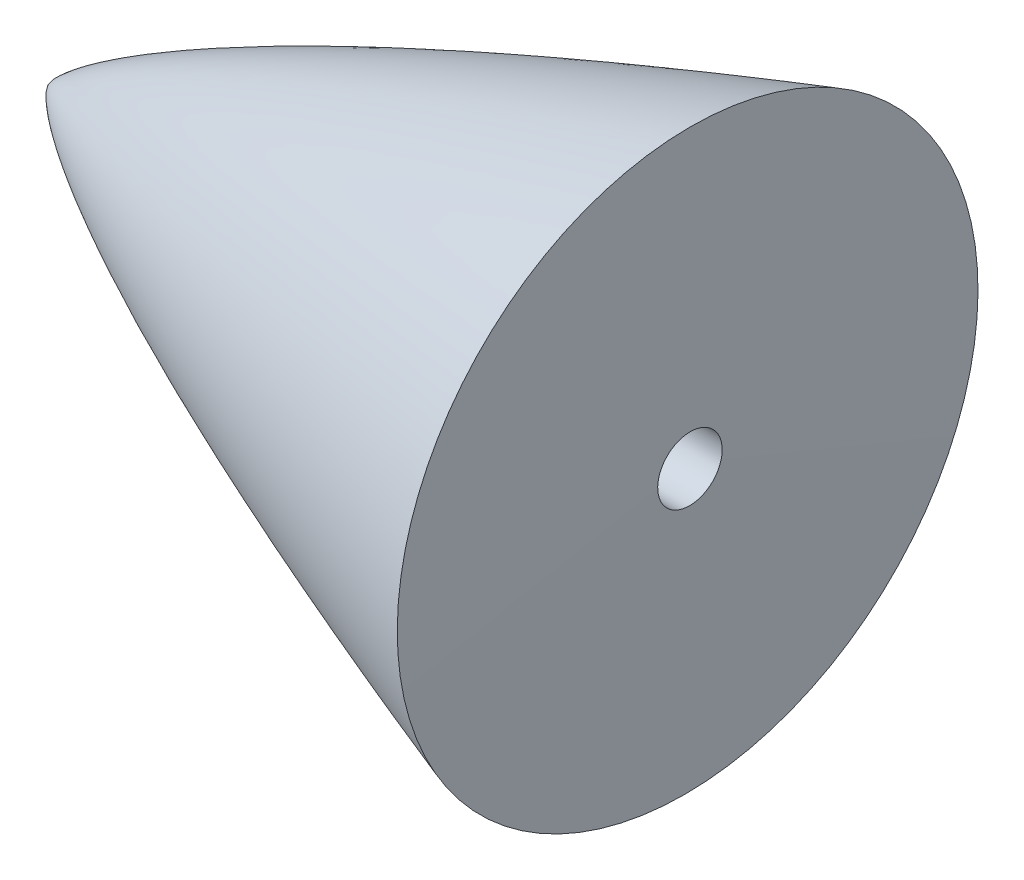
ISO-10303-21;
HEADER;
FILE_DESCRIPTION(('STEP AP214'),'2;1');
FILE_NAME('part.step','',(''),(''),'','','');
FILE_SCHEMA(('AUTOMOTIVE_DESIGN { 1 0 10303 214 1 1 1 1 }'));
ENDSEC;
DATA;
#1=APPLICATION_CONTEXT('core data for automotive mechanical design processes');
#2=APPLICATION_PROTOCOL_DEFINITION('international standard','automotive_design',2000,#1);
#3=PRODUCT_CONTEXT('',#1,'mechanical');
#4=PRODUCT('Part','Part','',(#3));
#5=PRODUCT_RELATED_PRODUCT_CATEGORY('part','',(#4));
#6=PRODUCT_DEFINITION_FORMATION('','',#4);
#7=PRODUCT_DEFINITION_CONTEXT('part definition',#1,'design');
#8=PRODUCT_DEFINITION('design','',#6,#7);
#9=PRODUCT_DEFINITION_SHAPE('','',#8);
#10=(LENGTH_UNIT() NAMED_UNIT(*) SI_UNIT(.MILLI.,.METRE.));
#11=(NAMED_UNIT(*) PLANE_ANGLE_UNIT() SI_UNIT($,.RADIAN.));
#12=(NAMED_UNIT(*) SI_UNIT($,.STERADIAN.) SOLID_ANGLE_UNIT());
#13=UNCERTAINTY_MEASURE_WITH_UNIT(LENGTH_MEASURE(1.E-05),#10,'distance_accuracy_value','');
#14=(GEOMETRIC_REPRESENTATION_CONTEXT(3) GLOBAL_UNCERTAINTY_ASSIGNED_CONTEXT((#13)) GLOBAL_UNIT_ASSIGNED_CONTEXT((#10,
#11,#12)) REPRESENTATION_CONTEXT('',''));
#15=CARTESIAN_POINT('',(0.,0.,0.));
#16=DIRECTION('',(0.,0.,1.));
#17=DIRECTION('',(1.,0.,0.));
#18=AXIS2_PLACEMENT_3D('',#15,#16,#17);
#19=CARTESIAN_POINT('',(50.8000000000005,22.5303567600831,0.));
#20=CARTESIAN_POINT('',(50.3465117854958,22.3812512382409,0.));
#21=CARTESIAN_POINT('',(49.442710434982,22.0829308392967,0.));
#22=CARTESIAN_POINT('',(47.1773804594535,21.3310775343089,0.));
#23=CARTESIAN_POINT('',(44.9449824900996,20.575969254353,0.));
#24=CARTESIAN_POINT('',(42.3170495750487,19.6775947745826,0.));
#25=CARTESIAN_POINT('',(39.9342074399655,18.8455213654888,0.));
#26=CARTESIAN_POINT('',(37.9136867647819,18.1332544680412,0.));
#27=CARTESIAN_POINT('',(35.9736316381102,17.4378758859734,0.));
#28=CARTESIAN_POINT('',(33.9915603629898,16.7185301483629,0.));
#29=CARTESIAN_POINT('',(31.5467375732389,15.8166109871259,0.));
#30=CARTESIAN_POINT('',(28.6052755986588,14.7086926881745,0.));
#31=CARTESIAN_POINT('',(25.195617979637,13.3860362700775,0.));
#32=CARTESIAN_POINT('',(21.3140120710095,11.8194498266795,0.));
#33=CARTESIAN_POINT('',(17.4617236726198,10.1904945755756,0.));
#34=CARTESIAN_POINT('',(13.6413400190153,8.48273894782136,0.));
#35=CARTESIAN_POINT('',(10.0936400641903,6.78232850197087,0.));
#36=CARTESIAN_POINT('',(7.06866265457857,5.20317059368231,0.));
#37=CARTESIAN_POINT('',(4.68834287270004,3.82830118825915,0.));
#38=CARTESIAN_POINT('',(3.03757211642044,2.76626899081453,0.));
#39=CARTESIAN_POINT('',(1.94795210676624,1.98434624807816,0.));
#40=CARTESIAN_POINT('',(1.22079366392824,1.39852484429859,0.));
#41=CARTESIAN_POINT('',(0.755145997118583,0.975924582867757,0.));
#42=CARTESIAN_POINT('',(0.461319422784189,0.674703687613275,0.));
#43=CARTESIAN_POINT('',(0.27829904475557,0.462127291497044,0.));
#44=CARTESIAN_POINT('',(0.165033444135209,0.312533910105992,0.));
#45=CARTESIAN_POINT('',(0.0968927723109344,0.209644328942817,0.));
#46=CARTESIAN_POINT('',(0.0563614371928829,0.139758552997633,0.));
#47=CARTESIAN_POINT('',(0.0275961366881815,0.0824356831018831,0.));
#48=CARTESIAN_POINT('',(0.0110726757431305,0.0442783153926129,0.));
#49=CARTESIAN_POINT('',(0.00340240039888783,0.0179503095970332,0.));
#50=CARTESIAN_POINT('',(0.,0.,0.));
#51=B_SPLINE_CURVE_WITH_KNOTS('',4,(#19,#20,#21,#22,#23,#24,#25,#26,#27,#28,#29,#30,#31,#32,#33,
#34,#35,#36,#37,#38,#39,#40,#41,#42,#43,#44,#45,#46,#47,#48,#49,#50),.UNSPECIFIED.,.F.,.F.,(5,1,
1,1,1,1,1,1,1,1,1,1,1,1,1,1,1,1,1,1,1,1,1,1,1,1,1,1,5),(0.,0.0341314652764168,
0.0682629305528335,0.136525859872037,0.170657325419194,0.204788790966351,0.238920256000712,
0.273051721035072,0.307183186492675,0.341314651950278,0.409577581686297,0.477840513795889,
0.546103441195251,0.614366380584495,0.682629290321098,0.750892221684726,0.802872165882953,
0.837003519315032,0.861991327744609,0.878950290734606,0.890368845138298,0.897914284738923,
0.903010842763492,0.906396837152728,0.908666277387763,0.910152012468246,0.911061650965127,
0.911664755719932,0.912854294796394),.UNSPECIFIED.);
#52=CARTESIAN_POINT('',(0.,0.,0.));
#53=DIRECTION('',(-0.999958208555171,0.00914227231782461,0.));
#54=AXIS1_PLACEMENT('',#52,#53);
#55=SURFACE_OF_REVOLUTION('',#51,#54);
#56=CARTESIAN_POINT('',(0.,0.,0.));
#57=VERTEX_POINT('',#56);
#58=VERTEX_LOOP('',#57);
#59=FACE_BOUND('',#58,.T.);
#60=CARTESIAN_POINT('',(50.5897840291561,-0.462524911678808,0.));
#61=DIRECTION('',(-0.999958208555171,0.00914227231782461,0.));
#62=DIRECTION('',(-0.00914227231782461,-0.999958208555171,0.));
#63=AXIS2_PLACEMENT_3D('',#60,#61,#62);
#64=CIRCLE('',#63,22.9938426176679);
#65=CARTESIAN_POINT('',(50.3795680583122,-23.4554065834416,0.));
#66=VERTEX_POINT('',#65);
#67=EDGE_CURVE('E11',#66,#66,#64,.T.);
#68=ORIENTED_EDGE('',*,*,#67,.T.);
#69=EDGE_LOOP('',(#68));
#70=FACE_BOUND('',#69,.T.);
#71=ADVANCED_FACE('F36',(#59,#70),#55,.T.);
#72=CARTESIAN_POINT('',(50.8,-0.464446843650133,0.));
#73=DIRECTION('',(-0.999958208555171,0.00914227231782461,0.));
#74=DIRECTION('',(-0.00914227231782461,-0.999958208555171,0.));
#75=AXIS2_PLACEMENT_3D('',#72,#73,#74);
#76=CONICAL_SURFACE('',#75,0.,1.56165392711869);
#77=CARTESIAN_POINT('',(50.7514405421361,-2.8563607226494,-1.67309737151764));
#78=CARTESIAN_POINT('',(50.7505841296063,-2.93717644828396,-1.57996674634571));
#79=CARTESIAN_POINT('',(50.7497999914759,-3.0112448269136,-1.48095453308958));
#80=CARTESIAN_POINT('',(50.7483918364705,-3.14434196213453,-1.27322399619832));
#81=CARTESIAN_POINT('',(50.7477679273403,-3.20336059846426,-1.16449920729777));
#82=CARTESIAN_POINT('',(50.7466057086025,-3.31334988802808,-0.921314581499885));
#83=CARTESIAN_POINT('',(50.7460978129312,-3.36145155301971,-0.785544776739851));
#84=CARTESIAN_POINT('',(50.7453300437503,-3.43418368507806,-0.507834177241092));
#85=CARTESIAN_POINT('',(50.7450702469713,-3.45880689084645,-0.365891487566549));
#86=CARTESIAN_POINT('',(50.7448057920375,-3.48387156345968,-0.0799014478196097));
#87=CARTESIAN_POINT('',(50.7448010978481,-3.48431644563201,0.0641456021243835));
#88=CARTESIAN_POINT('',(50.7450469209896,-3.46101689460632,0.350258514592375));
#89=CARTESIAN_POINT('',(50.7452974210271,-3.43727410051355,0.492324510703438));
#90=CARTESIAN_POINT('',(50.7460468579,-3.36627614746372,0.770457492977118));
#91=CARTESIAN_POINT('',(50.7465458001838,-3.31902047285333,0.906524347503266));
#92=CARTESIAN_POINT('',(50.7477786897789,-3.20233712506413,1.1687944924581));
#93=CARTESIAN_POINT('',(50.7485126399295,-3.13290918399867,1.29499766369024));
#94=CARTESIAN_POINT('',(50.750195741857,-2.97385199080143,1.53395743819739));
#95=CARTESIAN_POINT('',(50.7511448953963,-2.88422257323608,1.64671393134356));
#96=CARTESIAN_POINT('',(50.7532327267643,-2.68730735192309,1.85557852297479));
#97=CARTESIAN_POINT('',(50.7543714043865,-2.58002156741731,1.95168663960299));
#98=CARTESIAN_POINT('',(50.7568074220661,-2.35083594899108,2.12452926041214));
#99=CARTESIAN_POINT('',(50.7581047664778,-2.22893571401386,2.20126323273895));
#100=CARTESIAN_POINT('',(50.760822738251,-1.97398398516981,2.33317622345662));
#101=CARTESIAN_POINT('',(50.762243365602,-1.84093249226144,2.38835524370014));
#102=CARTESIAN_POINT('',(50.7651690080239,-1.5674512544145,2.47559350262932));
#103=CARTESIAN_POINT('',(50.7666740254057,-1.42702130743919,2.50765210787772));
#104=CARTESIAN_POINT('',(50.7697268528401,-1.1427727960002,2.54773717917423));
#105=CARTESIAN_POINT('',(50.7712746629065,-0.998954230452183,2.55576363753201));
#106=CARTESIAN_POINT('',(50.7743699459872,-0.71200874272283,2.54755650421177));
#107=CARTESIAN_POINT('',(50.775917418996,-0.568881831264569,2.53132253761456));
#108=CARTESIAN_POINT('',(50.7789683341685,-0.287384878091102,2.47505459583576));
#109=CARTESIAN_POINT('',(50.7804717763354,-0.14901483600634,2.43502062250318));
#110=CARTESIAN_POINT('',(50.783391563577,0.119039977201063,2.33228908134673));
#111=CARTESIAN_POINT('',(50.7848079089063,0.248724773729573,2.26959157982109));
#112=CARTESIAN_POINT('',(50.7875122146572,0.495727951831481,2.12331255418964));
#113=CARTESIAN_POINT('',(50.7888001750867,0.613046334163073,2.03973103136424));
#114=CARTESIAN_POINT('',(50.7912093679939,0.831983912251609,1.85405824893232));
#115=CARTESIAN_POINT('',(50.7923306036718,0.933603409336896,1.75196734468127));
#116=CARTESIAN_POINT('',(50.7943722741747,1.11826091675125,1.53217267803711));
#117=CARTESIAN_POINT('',(50.7952927090251,1.20129892942495,1.41446891761403));
#118=CARTESIAN_POINT('',(50.7969041299064,1.34643400938606,1.16679308611396));
#119=CARTESIAN_POINT('',(50.7975951219003,1.40853162089923,1.03682133398551));
#120=CARTESIAN_POINT('',(50.798725756223,1.51002585460792,0.768296497331849));
#121=CARTESIAN_POINT('',(50.7991653986015,1.54942248129365,0.629743414504022));
#122=CARTESIAN_POINT('',(50.7997791458669,1.60439561948354,0.347992254853583));
#123=CARTESIAN_POINT('',(50.7999532565197,1.61997264820911,0.204794278959652));
#124=CARTESIAN_POINT('',(50.8000302896833,1.62686598052559,-0.0821845241689591));
#125=CARTESIAN_POINT('',(50.7999332121534,1.61818228046272,-0.225965351491416));
#126=CARTESIAN_POINT('',(50.7994710355171,1.57680087554434,-0.51002693822133));
#127=CARTESIAN_POINT('',(50.7991059388479,1.5441033890596,-0.650307729444577));
#128=CARTESIAN_POINT('',(50.7981195435379,1.45562297875133,-0.923388415893206));
#129=CARTESIAN_POINT('',(50.797498245045,1.39984006824768,-1.05618831543488));
#130=CARTESIAN_POINT('',(50.7960192634217,1.26677207346667,-1.31053841210268));
#131=CARTESIAN_POINT('',(50.7951615789097,1.18948686350622,-1.43208854346725));
#132=CARTESIAN_POINT('',(50.7932366622785,1.01560836555483,-1.66048814500519));
#133=CARTESIAN_POINT('',(50.7921694299369,0.919015057071859,-1.76733759957627));
#134=CARTESIAN_POINT('',(50.7898580625002,0.709260548474779,-1.96330473851638));
#135=CARTESIAN_POINT('',(50.7886139241571,0.596099044164108,-2.05242209724845));
#136=CARTESIAN_POINT('',(50.7859859986975,0.356421665642527,-2.21039326844494));
#137=CARTESIAN_POINT('',(50.784602211386,0.229905772775997,-2.27924705260134));
#138=CARTESIAN_POINT('',(50.7817355009982,-0.0328937334359094,-2.39473890699881));
#139=CARTESIAN_POINT('',(50.7802525742996,-0.169177703711857,-2.44137616495998));
#140=CARTESIAN_POINT('',(50.7772303383731,-0.447637605633375,-2.51110662647389));
#141=CARTESIAN_POINT('',(50.7756910304018,-0.589813405970441,-2.53420035443711));
#142=CARTESIAN_POINT('',(50.7725996730609,-0.876018124931123,-2.5561903964113));
#143=CARTESIAN_POINT('',(50.7710476241695,-1.02004697412152,-2.555087614435));
#144=CARTESIAN_POINT('',(50.7679738900274,-1.30589761932847,-2.52871413308505));
#145=CARTESIAN_POINT('',(50.766452209071,-1.44771910258231,-2.50344003998413));
#146=CARTESIAN_POINT('',(50.7634812531531,-1.72513713601805,-2.42943435243064));
#147=CARTESIAN_POINT('',(50.7620319982157,-1.86073196383362,-2.38069630987818));
#148=CARTESIAN_POINT('',(50.7592467589207,-2.12174821695429,-2.26115419788496));
#149=CARTESIAN_POINT('',(50.7579106986294,-2.24717645976485,-2.19036507233279));
#150=CARTESIAN_POINT('',(50.7556843623932,-2.45646721697127,-2.0477794889763));
#151=CARTESIAN_POINT('',(50.7547630356315,-2.54317810167351,-1.98011485967064));
#152=CARTESIAN_POINT('',(50.7530222606583,-2.70715890829395,-1.83421639255701));
#153=CARTESIAN_POINT('',(50.7522027751768,-2.78443228379029,-1.75598644324214));
#154=CARTESIAN_POINT('',(50.7514405421361,-2.8563607226494,-1.67309737151764));
#155=B_SPLINE_CURVE_WITH_KNOTS('',3,(#77,#78,#79,#80,#81,#82,#83,#84,#85,#86,#87,#88,#89,#90,
#91,#92,#93,#94,#95,#96,#97,#98,#99,#100,#101,#102,#103,#104,#105,#106,#107,#108,#109,#110,#111,
#112,#113,#114,#115,#116,#117,#118,#119,#120,#121,#122,#123,#124,#125,#126,#127,#128,#129,#130,
#131,#132,#133,#134,#135,#136,#137,#138,#139,#140,#141,#142,#143,#144,#145,#146,#147,#148,#149,
#150,#151,#152,#153,#154),.UNSPECIFIED.,.T.,.F.,(4,2,2,2,2,2,2,2,2,2,2,2,2,2,2,2,2,2,2,2,2,2,2,
2,2,2,2,2,2,2,2,2,2,2,2,2,2,2,4),(0.,0.369632563386502,0.739513036116207,1.16953616373014,
1.5996922436114,2.02978756131045,2.45985373505214,2.88992934085102,3.32001014304574,
3.75009446737823,4.18017832300873,4.61027398390967,5.04036960784349,5.4704770147944,
5.90058455938061,6.33069875089244,6.76081290898901,7.19092580887117,7.62103868238282,
8.05114329917403,8.4812478616942,8.91134124524869,9.34143454373154,9.77151850298799,
10.2016025270172,10.6316826401007,11.0617625050359,11.4918448838836,11.9219277191876,
12.3520184519193,12.7821097854809,13.212216842821,13.6423143197127,14.0723957276371,
14.5025375291954,14.9327976050409,15.3627667282158,15.6918716799444,16.020855835282),.UNSPECIFIED.);
#156=CARTESIAN_POINT('',(50.7514405421361,-2.8563607226494,-1.67309737151764));
#157=VERTEX_POINT('',#156);
#158=EDGE_CURVE('E40',#157,#157,#155,.T.);
#159=ORIENTED_EDGE('',*,*,#158,.T.);
#160=EDGE_LOOP('',(#159));
#161=FACE_BOUND('',#160,.T.);
#162=ORIENTED_EDGE('',*,*,#67,.F.);
#163=EDGE_LOOP('',(#162));
#164=FACE_BOUND('',#163,.T.);
#165=ADVANCED_FACE('F73',(#161,#164),#76,.T.);
#166=CARTESIAN_POINT('',(50.7915081558575,-0.928816049304032,3.5291796143131E-06));
#167=DIRECTION('',(0.999832837713736,-0.0182837804978471,6.94720396487991E-08));
#168=DIRECTION('',(0.0182837804978471,0.999832837713738,0.));
#169=AXIS2_PLACEMENT_3D('',#166,#167,#168);
#170=CYLINDRICAL_SURFACE('',#169,2.55269999999999);
#171=CARTESIAN_POINT('',(25.3957540779286,-0.464408024658716,1.7645898072336E-06));
#172=DIRECTION('',(0.999832837713736,-0.0182837804978471,6.94720396487991E-08));
#173=DIRECTION('',(0.0182837804978471,0.999832837713738,0.));
#174=AXIS2_PLACEMENT_3D('',#171,#172,#173);
#175=CIRCLE('',#174,2.5527);
#176=CARTESIAN_POINT('',(25.4424270844055,2.08786526017314,1.7645898072336E-06));
#177=VERTEX_POINT('',#176);
#178=EDGE_CURVE('E61',#177,#177,#175,.T.);
#179=ORIENTED_EDGE('',*,*,#178,.F.);
#180=EDGE_LOOP('',(#179));
#181=FACE_BOUND('',#180,.T.);
#182=ORIENTED_EDGE('',*,*,#158,.F.);
#183=EDGE_LOOP('',(#182));
#184=FACE_BOUND('',#183,.T.);
#185=ADVANCED_FACE('F57',(#181,#184),#170,.F.);
#186=CARTESIAN_POINT('',(25.3957540779286,-0.464408024658716,1.7645898072336E-06));
#187=DIRECTION('',(0.999832837713736,-0.0182837804978471,6.94720396487991E-08));
#188=DIRECTION('',(0.0182837804978471,0.999832837713738,0.));
#189=AXIS2_PLACEMENT_3D('',#186,#187,#188);
#190=CONICAL_SURFACE('',#189,2.5527,1.02974425867665);
#191=CARTESIAN_POINT('',(23.862193572077,-0.436364053095161,1.65803241392623E-06));
#192=VERTEX_POINT('',#191);
#193=VERTEX_LOOP('',#192);
#194=FACE_BOUND('',#193,.T.);
#195=ORIENTED_EDGE('',*,*,#178,.T.);
#196=EDGE_LOOP('',(#195));
#197=FACE_BOUND('',#196,.T.);
#198=ADVANCED_FACE('F54',(#194,#197),#190,.F.);
#199=CLOSED_SHELL('',(#71,#165,#185,#198));
#200=MANIFOLD_SOLID_BREP('B2',#199);
#201=ADVANCED_BREP_SHAPE_REPRESENTATION('',(#18,#200),#14);
#202=SHAPE_DEFINITION_REPRESENTATION(#9,#201);
ENDSEC;
END-ISO-10303-21;
